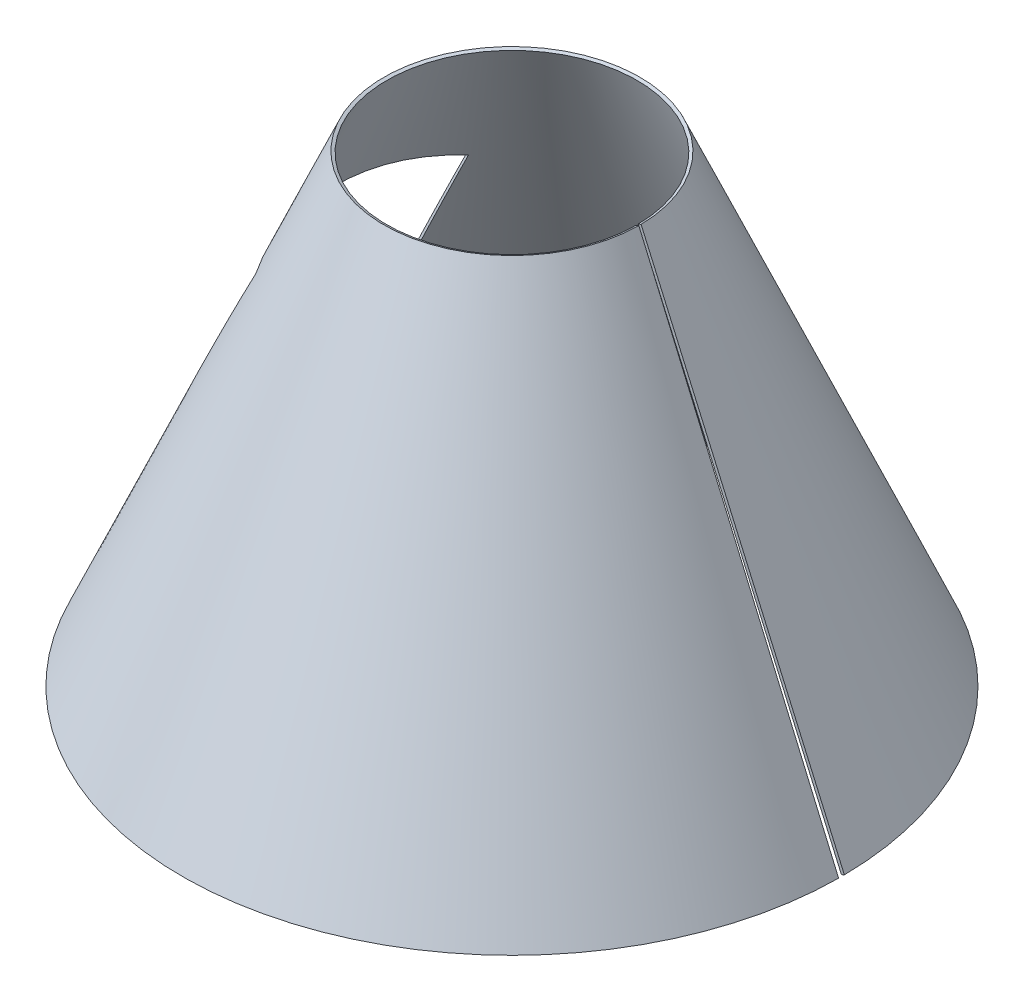
ISO-10303-21;
HEADER;
FILE_DESCRIPTION(('STEP AP214'),'2;1');
FILE_NAME('part.step','',(''),(''),'','','');
FILE_SCHEMA(('AUTOMOTIVE_DESIGN { 1 0 10303 214 1 1 1 1 }'));
ENDSEC;
DATA;
#1=APPLICATION_CONTEXT('core data for automotive mechanical design processes');
#2=APPLICATION_PROTOCOL_DEFINITION('international standard','automotive_design',2000,#1);
#3=PRODUCT_CONTEXT('',#1,'mechanical');
#4=PRODUCT('Part','Part','',(#3));
#5=PRODUCT_RELATED_PRODUCT_CATEGORY('part','',(#4));
#6=PRODUCT_DEFINITION_FORMATION('','',#4);
#7=PRODUCT_DEFINITION_CONTEXT('part definition',#1,'design');
#8=PRODUCT_DEFINITION('design','',#6,#7);
#9=PRODUCT_DEFINITION_SHAPE('','',#8);
#10=(LENGTH_UNIT() NAMED_UNIT(*) SI_UNIT(.MILLI.,.METRE.));
#11=(NAMED_UNIT(*) PLANE_ANGLE_UNIT() SI_UNIT($,.RADIAN.));
#12=(NAMED_UNIT(*) SI_UNIT($,.STERADIAN.) SOLID_ANGLE_UNIT());
#13=UNCERTAINTY_MEASURE_WITH_UNIT(LENGTH_MEASURE(1.E-05),#10,'distance_accuracy_value','');
#14=(GEOMETRIC_REPRESENTATION_CONTEXT(3) GLOBAL_UNCERTAINTY_ASSIGNED_CONTEXT((#13)) GLOBAL_UNIT_ASSIGNED_CONTEXT((#10,
#11,#12)) REPRESENTATION_CONTEXT('',''));
#15=CARTESIAN_POINT('',(0.,0.,0.));
#16=DIRECTION('',(0.,0.,1.));
#17=DIRECTION('',(1.,0.,0.));
#18=AXIS2_PLACEMENT_3D('',#15,#16,#17);
#19=CARTESIAN_POINT('',(-390.673150662865,216.435079884908,-171.737690938259));
#20=CARTESIAN_POINT('',(-377.142683223783,245.126072546884,-171.517261910652));
#21=CARTESIAN_POINT('',(-364.079445057438,272.62887752062,-171.277092645674));
#22=CARTESIAN_POINT('',(-345.188558556074,312.100888842921,-170.875085638939));
#23=CARTESIAN_POINT('',(-339.008901364654,324.96118851652,-170.734289530239));
#24=CARTESIAN_POINT('',(-329.915474925796,343.806081876174,-170.512853786897));
#25=CARTESIAN_POINT('',(-326.913673620994,350.013453637603,-170.437345026818));
#26=CARTESIAN_POINT('',(-322.454971975635,359.213122242057,-170.321620232035));
#27=CARTESIAN_POINT('',(-320.976071302533,362.261113603926,-170.28263564526));
#28=CARTESIAN_POINT('',(-318.768717073403,366.80525338731,-170.223560291441));
#29=CARTESIAN_POINT('',(-318.034765115157,368.31532543854,-170.203768799666));
#30=CARTESIAN_POINT('',(-316.936585865956,370.573471700521,-170.173934347429));
#31=CARTESIAN_POINT('',(-316.570984230142,371.325026818701,-170.163964996646));
#32=CARTESIAN_POINT('',(-316.023268879101,372.450619042264,-170.148974485174));
#33=CARTESIAN_POINT('',(-315.840811612484,372.8255263745,-170.143971567283));
#34=CARTESIAN_POINT('',(-315.567297479185,373.387452259424,-170.136458110032));
#35=CARTESIAN_POINT('',(-315.476154729187,373.574688368827,-170.133952110889));
#36=CARTESIAN_POINT('',(-315.339483544691,373.855433754575,-170.130190847253));
#37=CARTESIAN_POINT('',(-315.293933639942,373.948997420097,-170.128936715222));
#38=CARTESIAN_POINT('',(-315.225619517799,374.089315723793,-170.127054951597));
#39=CARTESIAN_POINT('',(-315.202849932916,374.136083959258,-170.126427602794));
#40=CARTESIAN_POINT('',(-315.168698239316,374.206229513811,-170.125486438274));
#41=CARTESIAN_POINT('',(-315.157314788735,374.229610232225,-170.125172693215));
#42=CARTESIAN_POINT('',(-315.13454878215,374.276369402829,-170.124545156007));
#43=CARTESIAN_POINT('',(-315.125530541461,374.294891869638,-170.124296550306));
#44=CARTESIAN_POINT('',(-301.03544590186,403.234028950793,-169.735819361505));
#45=CARTESIAN_POINT('',(-287.481589285338,430.740189038842,-169.309258917199));
#46=CARTESIAN_POINT('',(-261.433075147547,482.943021837675,-168.333397765728));
#47=CARTESIAN_POINT('',(-248.938581471718,507.639764686927,-167.784168308241));
#48=CARTESIAN_POINT('',(-236.976081085843,530.931623570603,-167.17252728846));
#49=CARTESIAN_POINT('',(-386.475528777364,214.44133454028,-169.892440275844));
#50=CARTESIAN_POINT('',(-372.967732995943,243.132326505835,-169.620437952624));
#51=CARTESIAN_POINT('',(-359.929215840591,270.635132175993,-169.326606269965));
#52=CARTESIAN_POINT('',(-341.078890354475,310.107143498294,-168.841231708122));
#53=CARTESIAN_POINT('',(-334.91333357045,322.967443171892,-168.672167955316));
#54=CARTESIAN_POINT('',(-325.841980224387,341.812336531546,-168.407650523587));
#55=CARTESIAN_POINT('',(-322.847690375846,348.019708292975,-168.317667866462));
#56=CARTESIAN_POINT('',(-318.400493196564,357.219376897429,-168.180067241998));
#57=CARTESIAN_POINT('',(-316.925466893057,360.267368259299,-168.13376321701));
#58=CARTESIAN_POINT('',(-314.723984375424,364.811508042682,-168.063668112135));
#59=CARTESIAN_POINT('',(-313.991999680564,366.321580093912,-168.040196604536));
#60=CARTESIAN_POINT('',(-312.896786470546,368.579726355893,-168.004832062819));
#61=CARTESIAN_POINT('',(-312.532176038479,369.331281474073,-167.993017671262));
#62=CARTESIAN_POINT('',(-311.985951292204,370.456873697636,-167.975257092601));
#63=CARTESIAN_POINT('',(-311.803991527033,370.831781029872,-167.969330401309));
#64=CARTESIAN_POINT('',(-311.53122459733,371.393706914797,-167.960430658757));
#65=CARTESIAN_POINT('',(-311.440331073769,371.5809430242,-167.957462460313));
#66=CARTESIAN_POINT('',(-311.30403396699,371.861688409948,-167.95300774159));
#67=CARTESIAN_POINT('',(-311.25860879449,371.95525207547,-167.95152243184));
#68=CARTESIAN_POINT('',(-311.190481830262,372.095570379165,-167.949293862623));
#69=CARTESIAN_POINT('',(-311.167774641274,372.14233861463,-167.948550905453));
#70=CARTESIAN_POINT('',(-311.133716556405,372.212484169183,-167.947436318634));
#71=CARTESIAN_POINT('',(-311.122364311216,372.235864887598,-167.947064764516));
#72=CARTESIAN_POINT('',(-311.099660720378,372.282624058202,-167.946321605941));
#73=CARTESIAN_POINT('',(-311.090667206449,372.30114652501,-167.946027197162));
#74=CARTESIAN_POINT('',(-297.039221410304,401.240283606165,-167.485981265568));
#75=CARTESIAN_POINT('',(-283.528223926376,428.746443694214,-166.984565951664));
#76=CARTESIAN_POINT('',(-257.575263272773,480.949276493047,-165.853360954649));
#77=CARTESIAN_POINT('',(-245.133466900078,505.646017022941,-165.223641105623));
#78=CARTESIAN_POINT('',(-233.229258238122,528.937878225975,-164.529366671211));
#79=B_SPLINE_SURFACE_WITH_KNOTS('',1,3,((#19,#20,#21,#22,#23,#24,#25,#26,#27,#28,#29,#30,#31,
#32,#33,#34,#35,#36,#37,#38,#39,#40,#41,#42,#43,#44,#45,#46,#47,#48),(#49,#50,#51,#52,#53,#54,
#55,#56,#57,#58,#59,#60,#61,#62,#63,#64,#65,#66,#67,#68,#69,#70,#71,#72,#73,#74,#75,#76,#77,
#78)),.UNSPECIFIED.,.F.,.F.,.F.,(2,2),(4,2,2,2,2,2,2,2,2,2,2,2,2,2,4),(0.,1.),(0.,0.25,0.375,
0.4375,0.46875,0.484375,0.4921875,0.49609375,0.498046875,0.4990234375,0.49951171875,
0.499755859375,0.5,0.75,1.),.UNSPECIFIED.);
#80=CARTESIAN_POINT('',(-386.475528777364,214.44133454028,-169.892440275844));
#81=CARTESIAN_POINT('',(-390.673150662865,216.435079884908,-171.737690938259));
#82=B_SPLINE_CURVE_WITH_KNOTS('',1,(#80,#81),.UNSPECIFIED.,.F.,.F.,(2,2),(0.,1.),.UNSPECIFIED.);
#83=CARTESIAN_POINT('',(-386.475528777363,214.44133454028,-169.892440275844));
#84=VERTEX_POINT('',#83);
#85=CARTESIAN_POINT('',(-390.673150662865,216.435079884908,-171.737690938259));
#86=VERTEX_POINT('',#85);
#87=EDGE_CURVE('E13',#84,#86,#82,.T.);
#88=CARTESIAN_POINT('',(-386.475528777364,214.44133454028,-169.892440275844));
#89=CARTESIAN_POINT('',(-372.967732995943,243.132326505835,-169.620437952624));
#90=CARTESIAN_POINT('',(-359.929215840591,270.635132175993,-169.326606269965));
#91=CARTESIAN_POINT('',(-341.078890354475,310.107143498294,-168.841231708122));
#92=CARTESIAN_POINT('',(-334.91333357045,322.967443171892,-168.672167955316));
#93=CARTESIAN_POINT('',(-325.841980224387,341.812336531546,-168.407650523587));
#94=CARTESIAN_POINT('',(-322.847690375846,348.019708292975,-168.317667866462));
#95=CARTESIAN_POINT('',(-318.400493196564,357.219376897429,-168.180067241998));
#96=CARTESIAN_POINT('',(-316.925466893057,360.267368259299,-168.13376321701));
#97=CARTESIAN_POINT('',(-314.723984375424,364.811508042682,-168.063668112135));
#98=CARTESIAN_POINT('',(-313.991999680564,366.321580093912,-168.040196604536));
#99=CARTESIAN_POINT('',(-312.896786470546,368.579726355893,-168.004832062819));
#100=CARTESIAN_POINT('',(-312.532176038479,369.331281474073,-167.993017671262));
#101=CARTESIAN_POINT('',(-311.985951292204,370.456873697636,-167.975257092601));
#102=CARTESIAN_POINT('',(-311.803991527033,370.831781029872,-167.969330401309));
#103=CARTESIAN_POINT('',(-311.53122459733,371.393706914797,-167.960430658757));
#104=CARTESIAN_POINT('',(-311.440331073769,371.5809430242,-167.957462460313));
#105=CARTESIAN_POINT('',(-311.30403396699,371.861688409948,-167.95300774159));
#106=CARTESIAN_POINT('',(-311.25860879449,371.95525207547,-167.95152243184));
#107=CARTESIAN_POINT('',(-311.190481830262,372.095570379165,-167.949293862623));
#108=CARTESIAN_POINT('',(-311.167774641274,372.14233861463,-167.948550905453));
#109=CARTESIAN_POINT('',(-311.133716556405,372.212484169183,-167.947436318634));
#110=CARTESIAN_POINT('',(-311.122364311216,372.235864887598,-167.947064764516));
#111=CARTESIAN_POINT('',(-311.099660720378,372.282624058202,-167.946321605941));
#112=CARTESIAN_POINT('',(-311.090667206449,372.30114652501,-167.946027197162));
#113=CARTESIAN_POINT('',(-297.039221410304,401.240283606165,-167.485981265568));
#114=CARTESIAN_POINT('',(-283.528223926376,428.746443694214,-166.984565951664));
#115=CARTESIAN_POINT('',(-257.575263272773,480.949276493047,-165.853360954649));
#116=CARTESIAN_POINT('',(-245.133466900078,505.646017022941,-165.223641105623));
#117=CARTESIAN_POINT('',(-233.229258238122,528.937878225975,-164.529366671211));
#118=B_SPLINE_CURVE_WITH_KNOTS('',3,(#88,#89,#90,#91,#92,#93,#94,#95,#96,#97,#98,#99,#100,#101,
#102,#103,#104,#105,#106,#107,#108,#109,#110,#111,#112,#113,#114,#115,#116,#117),.UNSPECIFIED.,
.F.,.F.,(4,2,2,2,2,2,2,2,2,2,2,2,2,2,4),(0.,0.25,0.375,0.4375,0.46875,0.484375,0.4921875,
0.49609375,0.498046875,0.4990234375,0.49951171875,0.499755859375,0.5,0.75,1.),.UNSPECIFIED.);
#119=CARTESIAN_POINT('',(-233.229258238122,528.937878225975,-164.529366671211));
#120=VERTEX_POINT('',#119);
#121=EDGE_CURVE('E149',#84,#120,#118,.T.);
#122=CARTESIAN_POINT('',(-233.229258238122,528.937878225975,-164.529366671211));
#123=CARTESIAN_POINT('',(-236.976081085843,530.931623570603,-167.17252728846));
#124=B_SPLINE_CURVE_WITH_KNOTS('',1,(#122,#123),.UNSPECIFIED.,.F.,.F.,(2,2),(0.,1.),.UNSPECIFIED.);
#125=CARTESIAN_POINT('',(-236.976081085843,530.931623570603,-167.17252728846));
#126=VERTEX_POINT('',#125);
#127=EDGE_CURVE('E108',#120,#126,#124,.T.);
#128=CARTESIAN_POINT('',(-236.976081085843,530.931623570603,-167.17252728846));
#129=CARTESIAN_POINT('',(-248.938581471718,507.639764686927,-167.784168308241));
#130=CARTESIAN_POINT('',(-261.433075147547,482.943021837675,-168.333397765728));
#131=CARTESIAN_POINT('',(-287.481589285338,430.740189038842,-169.309258917199));
#132=CARTESIAN_POINT('',(-301.03544590186,403.234028950793,-169.735819361505));
#133=CARTESIAN_POINT('',(-315.125530541461,374.294891869638,-170.124296550306));
#134=CARTESIAN_POINT('',(-315.13454878215,374.276369402829,-170.124545156007));
#135=CARTESIAN_POINT('',(-315.157314788735,374.229610232225,-170.125172693215));
#136=CARTESIAN_POINT('',(-315.168698239316,374.206229513811,-170.125486438274));
#137=CARTESIAN_POINT('',(-315.202849932916,374.136083959258,-170.126427602794));
#138=CARTESIAN_POINT('',(-315.225619517799,374.089315723793,-170.127054951597));
#139=CARTESIAN_POINT('',(-315.293933639942,373.948997420097,-170.128936715222));
#140=CARTESIAN_POINT('',(-315.339483544691,373.855433754575,-170.130190847253));
#141=CARTESIAN_POINT('',(-315.476154729187,373.574688368827,-170.133952110889));
#142=CARTESIAN_POINT('',(-315.567297479185,373.387452259424,-170.136458110032));
#143=CARTESIAN_POINT('',(-315.840811612484,372.8255263745,-170.143971567283));
#144=CARTESIAN_POINT('',(-316.023268879101,372.450619042264,-170.148974485174));
#145=CARTESIAN_POINT('',(-316.570984230142,371.325026818701,-170.163964996646));
#146=CARTESIAN_POINT('',(-316.936585865956,370.573471700521,-170.173934347429));
#147=CARTESIAN_POINT('',(-318.034765115157,368.31532543854,-170.203768799666));
#148=CARTESIAN_POINT('',(-318.768717073403,366.80525338731,-170.223560291441));
#149=CARTESIAN_POINT('',(-320.976071302533,362.261113603926,-170.28263564526));
#150=CARTESIAN_POINT('',(-322.454971975635,359.213122242057,-170.321620232035));
#151=CARTESIAN_POINT('',(-326.913673620994,350.013453637603,-170.437345026818));
#152=CARTESIAN_POINT('',(-329.915474925796,343.806081876174,-170.512853786897));
#153=CARTESIAN_POINT('',(-339.008901364654,324.96118851652,-170.734289530239));
#154=CARTESIAN_POINT('',(-345.188558556074,312.100888842921,-170.875085638939));
#155=CARTESIAN_POINT('',(-364.079445057438,272.62887752062,-171.277092645674));
#156=CARTESIAN_POINT('',(-377.142683223783,245.126072546884,-171.517261910652));
#157=CARTESIAN_POINT('',(-390.673150662865,216.435079884908,-171.737690938259));
#158=B_SPLINE_CURVE_WITH_KNOTS('',3,(#128,#129,#130,#131,#132,#133,#134,#135,#136,#137,#138,
#139,#140,#141,#142,#143,#144,#145,#146,#147,#148,#149,#150,#151,#152,#153,#154,#155,#156,#157),
.UNSPECIFIED.,.F.,.F.,(4,2,2,2,2,2,2,2,2,2,2,2,2,2,4),(0.,0.25,0.5,0.500244140625,0.50048828125,
0.5009765625,0.501953125,0.50390625,0.5078125,0.515625,0.53125,0.5625,0.625,0.75,1.),.UNSPECIFIED.);
#159=EDGE_CURVE('E153',#86,#126,#158,.F.);
#160=ORIENTED_EDGE('',*,*,#87,.F.);
#161=ORIENTED_EDGE('',*,*,#121,.T.);
#162=ORIENTED_EDGE('',*,*,#127,.T.);
#163=ORIENTED_EDGE('',*,*,#159,.F.);
#164=EDGE_LOOP('',(#160,#161,#162,#163));
#165=FACE_BOUND('',#164,.T.);
#166=ADVANCED_FACE('F94',(#165),#79,.T.);
#167=CARTESIAN_POINT('',(-236.976081085843,530.931623570603,-167.17252728846));
#168=CARTESIAN_POINT('',(-251.323305995867,537.516709583,-141.867408016106));
#169=CARTESIAN_POINT('',(-262.434664577007,542.456126064863,-114.865438189882));
#170=CARTESIAN_POINT('',(-277.481132754529,549.041682717702,-58.705011994568));
#171=CARTESIAN_POINT('',(-281.416917434273,550.688145749705,-29.542896380577));
#172=CARTESIAN_POINT('',(-281.417079012583,550.688441308532,29.5401329297532));
#173=CARTESIAN_POINT('',(-277.480645448042,549.042126035032,58.70660870777));
#174=CARTESIAN_POINT('',(-262.433484551877,542.456569382198,114.867768240006));
#175=CARTESIAN_POINT('',(-251.32208458411,537.517001462712,141.8689192674));
#176=CARTESIAN_POINT('',(-236.976081085524,530.931623570624,167.172527288895));
#177=CARTESIAN_POINT('',(-233.229258238122,528.937878225975,-164.529366671211));
#178=CARTESIAN_POINT('',(-247.312678995283,535.522979328195,-139.598192642879));
#179=CARTESIAN_POINT('',(-258.21308199642,540.462380720236,-113.015125673388));
#180=CARTESIAN_POINT('',(-272.972164402214,547.047937373074,-57.7486541686274));
#181=CARTESIAN_POINT('',(-276.831619425719,548.694400405078,-29.0615357853971));
#182=CARTESIAN_POINT('',(-276.831776277398,548.694695963905,29.0588173611785));
#183=CARTESIAN_POINT('',(-272.971681963581,547.048380690405,57.7502242474028));
#184=CARTESIAN_POINT('',(-258.21191812975,540.462824037571,113.017416953411));
#185=CARTESIAN_POINT('',(-247.311475295622,535.523271228603,139.599678770708));
#186=CARTESIAN_POINT('',(-233.229258237808,528.937878225996,164.52936667164));
#187=B_SPLINE_SURFACE_WITH_KNOTS('',1,3,((#167,#168,#169,#170,#171,#172,#173,#174,#175,#176),
(#177,#178,#179,#180,#181,#182,#183,#184,#185,#186)),.UNSPECIFIED.,.F.,.F.,.F.,(2,2),(4,2,2,2,
4),(0.,1.),(0.,0.25,0.5,0.75,1.),.UNSPECIFIED.);
#188=CARTESIAN_POINT('',(-233.229258238122,528.937878225975,-164.529366671211));
#189=CARTESIAN_POINT('',(-247.312678995283,535.522979328195,-139.598192642879));
#190=CARTESIAN_POINT('',(-258.21308199642,540.462380720236,-113.015125673388));
#191=CARTESIAN_POINT('',(-272.972164402214,547.047937373074,-57.7486541686274));
#192=CARTESIAN_POINT('',(-276.831619425719,548.694400405078,-29.0615357853971));
#193=CARTESIAN_POINT('',(-276.831776277398,548.694695963905,29.0588173611785));
#194=CARTESIAN_POINT('',(-272.971681963581,547.048380690405,57.7502242474028));
#195=CARTESIAN_POINT('',(-258.21191812975,540.462824037571,113.017416953411));
#196=CARTESIAN_POINT('',(-247.311475295622,535.523271228603,139.599678770708));
#197=CARTESIAN_POINT('',(-233.229258237808,528.937878225996,164.52936667164));
#198=B_SPLINE_CURVE_WITH_KNOTS('',3,(#188,#189,#190,#191,#192,#193,#194,#195,#196,#197),
.UNSPECIFIED.,.F.,.F.,(4,2,2,2,4),(0.,0.25,0.5,0.75,1.),.UNSPECIFIED.);
#199=CARTESIAN_POINT('',(-233.229258237808,528.937878225996,164.529366671639));
#200=VERTEX_POINT('',#199);
#201=EDGE_CURVE('E171',#120,#200,#198,.T.);
#202=CARTESIAN_POINT('',(-233.229258237808,528.937878225996,164.52936667164));
#203=CARTESIAN_POINT('',(-236.976081085524,530.931623570624,167.172527288895));
#204=B_SPLINE_CURVE_WITH_KNOTS('',1,(#202,#203),.UNSPECIFIED.,.F.,.F.,(2,2),(0.,1.),.UNSPECIFIED.);
#205=CARTESIAN_POINT('',(-236.976081085524,530.931623570624,167.172527288895));
#206=VERTEX_POINT('',#205);
#207=EDGE_CURVE('E208',#200,#206,#204,.T.);
#208=CARTESIAN_POINT('',(-236.976081085524,530.931623570624,167.172527288895));
#209=CARTESIAN_POINT('',(-251.32208458411,537.517001462712,141.8689192674));
#210=CARTESIAN_POINT('',(-262.433484551877,542.456569382198,114.867768240006));
#211=CARTESIAN_POINT('',(-277.480645448042,549.042126035032,58.70660870777));
#212=CARTESIAN_POINT('',(-281.417079012583,550.688441308532,29.5401329297532));
#213=CARTESIAN_POINT('',(-281.416917434273,550.688145749705,-29.542896380577));
#214=CARTESIAN_POINT('',(-277.481132754529,549.041682717702,-58.705011994568));
#215=CARTESIAN_POINT('',(-262.434664577007,542.456126064863,-114.865438189882));
#216=CARTESIAN_POINT('',(-251.323305995867,537.516709583,-141.867408016106));
#217=CARTESIAN_POINT('',(-236.976081085843,530.931623570603,-167.17252728846));
#218=B_SPLINE_CURVE_WITH_KNOTS('',3,(#208,#209,#210,#211,#212,#213,#214,#215,#216,#217),
.UNSPECIFIED.,.F.,.F.,(4,2,2,2,4),(0.,0.25,0.5,0.75,1.),.UNSPECIFIED.);
#219=EDGE_CURVE('E331',#126,#206,#218,.F.);
#220=ORIENTED_EDGE('',*,*,#127,.F.);
#221=ORIENTED_EDGE('',*,*,#201,.T.);
#222=ORIENTED_EDGE('',*,*,#207,.T.);
#223=ORIENTED_EDGE('',*,*,#219,.F.);
#224=EDGE_LOOP('',(#220,#221,#222,#223));
#225=FACE_BOUND('',#224,.T.);
#226=ADVANCED_FACE('F215',(#225),#187,.T.);
#227=CARTESIAN_POINT('',(-236.976081085524,530.931623570624,167.172527288895));
#228=CARTESIAN_POINT('',(-248.938581454255,507.639764720328,167.784168307821));
#229=CARTESIAN_POINT('',(-261.433075120931,482.943021887761,168.333397766826));
#230=CARTESIAN_POINT('',(-280.9694607239,443.790897288636,169.065293631943));
#231=CARTESIAN_POINT('',(-287.613932122674,430.389003162598,169.294264174531));
#232=CARTESIAN_POINT('',(-297.777991958567,409.759383084043,169.618480317016));
#233=CARTESIAN_POINT('',(-301.198899788214,402.795046576273,169.723367286214));
#234=CARTESIAN_POINT('',(-306.37941519423,392.216847092248,169.876522057982));
#235=CARTESIAN_POINT('',(-308.114445738627,388.668831477179,169.926879066727));
#236=CARTESIAN_POINT('',(-310.729255731652,383.313884373979,170.001460273809));
#237=CARTESIAN_POINT('',(-311.60290308127,381.523414726144,170.026161710959));
#238=CARTESIAN_POINT('',(-312.916437048511,378.829479334248,170.062987137892));
#239=CARTESIAN_POINT('',(-313.354792194105,377.930129050256,170.075224497447));
#240=CARTESIAN_POINT('',(-314.013090256152,376.579045894234,170.093525375928));
#241=CARTESIAN_POINT('',(-314.23265050074,376.128341887223,170.099616475616));
#242=CARTESIAN_POINT('',(-314.562182154259,375.451771444193,170.108739527627));
#243=CARTESIAN_POINT('',(-314.672057919867,375.226162224432,170.111778278732));
#244=CARTESIAN_POINT('',(-314.836919383765,374.887619786663,170.116333030253));
#245=CARTESIAN_POINT('',(-314.891881174312,374.77475087272,170.117850718239));
#246=CARTESIAN_POINT('',(-314.974335813228,374.605415349772,170.120126409475));
#247=CARTESIAN_POINT('',(-315.001822685049,374.548964816785,170.120884833095));
#248=CARTESIAN_POINT('',(-315.043055980959,374.464280979295,170.122022258722));
#249=CARTESIAN_POINT('',(-315.056800910961,374.436051693791,170.122401365631));
#250=CARTESIAN_POINT('',(-315.084291767004,374.379590443459,170.123159509576));
#251=CARTESIAN_POINT('',(-315.100402008404,374.346502493162,170.123603733061));
#252=CARTESIAN_POINT('',(-326.767063425402,350.384750479868,170.445264809241));
#253=CARTESIAN_POINT('',(-338.891596354047,325.258226025306,170.7410833002));
#254=CARTESIAN_POINT('',(-364.079445022131,272.628877595571,171.277092644155));
#255=CARTESIAN_POINT('',(-377.142683199905,245.126072596854,171.517261910949));
#256=CARTESIAN_POINT('',(-390.673150662546,216.435079884922,171.737690938964));
#257=CARTESIAN_POINT('',(-233.229258237808,528.937878225996,164.52936667164));
#258=CARTESIAN_POINT('',(-245.133466882703,505.646017056342,165.223641105078));
#259=CARTESIAN_POINT('',(-257.57526324628,480.949276543133,165.853360955557));
#260=CARTESIAN_POINT('',(-277.039983736101,441.797151944008,166.701764704828));
#261=CARTESIAN_POINT('',(-283.661796621379,428.39525781797,166.968868934795));
#262=CARTESIAN_POINT('',(-293.793588444839,407.765637739415,167.349125171656));
#263=CARTESIAN_POINT('',(-297.204026919509,400.801301231646,167.472498895431));
#264=CARTESIAN_POINT('',(-302.369252886733,390.223101747621,167.653081631403));
#265=CARTESIAN_POINT('',(-304.099256052432,386.675086132552,167.712530941223));
#266=CARTESIAN_POINT('',(-306.706626725088,381.320139029352,167.800673605276));
#267=CARTESIAN_POINT('',(-307.577811259333,379.529669381517,167.829882696104));
#268=CARTESIAN_POINT('',(-308.887676203955,376.83573398962,167.873450176687));
#269=CARTESIAN_POINT('',(-309.324812542092,375.936383705629,167.887931649675));
#270=CARTESIAN_POINT('',(-309.981288663574,374.585300549606,167.909593819524));
#271=CARTESIAN_POINT('',(-310.200242639744,374.134596542595,167.916804536539));
#272=CARTESIAN_POINT('',(-310.52886645461,373.458026099565,167.927605792101));
#273=CARTESIAN_POINT('',(-310.638439867997,373.232416879805,167.931203740649));
#274=CARTESIAN_POINT('',(-310.802848194095,372.893874442035,167.936596982383));
#275=CARTESIAN_POINT('',(-310.857659003797,372.781005528093,167.938394116115));
#276=CARTESIAN_POINT('',(-310.939887269023,372.611670005144,167.941088899437));
#277=CARTESIAN_POINT('',(-310.96729869921,372.555219472158,167.941987007665));
#278=CARTESIAN_POINT('',(-311.008418857056,372.470535634668,167.943333941065));
#279=CARTESIAN_POINT('',(-311.022126078434,372.442306349164,167.943782880709));
#280=CARTESIAN_POINT('',(-311.049541525357,372.385845098832,167.944680683742));
#281=CARTESIAN_POINT('',(-311.065607582665,372.352757148535,167.945206742813));
#282=CARTESIAN_POINT('',(-322.700275841644,348.39100513524,168.326127100392));
#283=CARTESIAN_POINT('',(-334.795448490935,323.264480680678,168.679440184208));
#284=CARTESIAN_POINT('',(-359.92921580535,270.635132250944,169.326606268306));
#285=CARTESIAN_POINT('',(-372.967732972109,243.132326555805,169.620437952825));
#286=CARTESIAN_POINT('',(-386.475528777048,214.441334540294,169.892440276543));
#287=B_SPLINE_SURFACE_WITH_KNOTS('',1,3,((#227,#228,#229,#230,#231,#232,#233,#234,#235,#236,
#237,#238,#239,#240,#241,#242,#243,#244,#245,#246,#247,#248,#249,#250,#251,#252,#253,#254,#255,
#256),(#257,#258,#259,#260,#261,#262,#263,#264,#265,#266,#267,#268,#269,#270,#271,#272,#273,
#274,#275,#276,#277,#278,#279,#280,#281,#282,#283,#284,#285,#286)),.UNSPECIFIED.,.F.,.F.,.F.,(2,
2),(4,2,2,2,2,2,2,2,2,2,2,2,2,2,4),(0.,1.),(0.,0.25,0.375,0.4375,0.46875,0.484375,0.4921875,
0.49609375,0.498046875,0.4990234375,0.49951171875,0.499755859375,0.5,0.75,1.),.UNSPECIFIED.);
#288=CARTESIAN_POINT('',(-233.229258237808,528.937878225996,164.52936667164));
#289=CARTESIAN_POINT('',(-245.133466882703,505.646017056342,165.223641105078));
#290=CARTESIAN_POINT('',(-257.57526324628,480.949276543133,165.853360955557));
#291=CARTESIAN_POINT('',(-277.039983736101,441.797151944008,166.701764704828));
#292=CARTESIAN_POINT('',(-283.661796621379,428.39525781797,166.968868934795));
#293=CARTESIAN_POINT('',(-293.793588444839,407.765637739415,167.349125171656));
#294=CARTESIAN_POINT('',(-297.204026919509,400.801301231646,167.472498895431));
#295=CARTESIAN_POINT('',(-302.369252886733,390.223101747621,167.653081631403));
#296=CARTESIAN_POINT('',(-304.099256052432,386.675086132552,167.712530941223));
#297=CARTESIAN_POINT('',(-306.706626725088,381.320139029352,167.800673605276));
#298=CARTESIAN_POINT('',(-307.577811259333,379.529669381517,167.829882696104));
#299=CARTESIAN_POINT('',(-308.887676203955,376.83573398962,167.873450176687));
#300=CARTESIAN_POINT('',(-309.324812542092,375.936383705629,167.887931649675));
#301=CARTESIAN_POINT('',(-309.981288663574,374.585300549606,167.909593819524));
#302=CARTESIAN_POINT('',(-310.200242639744,374.134596542595,167.916804536539));
#303=CARTESIAN_POINT('',(-310.52886645461,373.458026099565,167.927605792101));
#304=CARTESIAN_POINT('',(-310.638439867997,373.232416879805,167.931203740649));
#305=CARTESIAN_POINT('',(-310.802848194095,372.893874442035,167.936596982383));
#306=CARTESIAN_POINT('',(-310.857659003797,372.781005528093,167.938394116115));
#307=CARTESIAN_POINT('',(-310.939887269023,372.611670005144,167.941088899437));
#308=CARTESIAN_POINT('',(-310.96729869921,372.555219472158,167.941987007665));
#309=CARTESIAN_POINT('',(-311.008418857056,372.470535634668,167.943333941065));
#310=CARTESIAN_POINT('',(-311.022126078434,372.442306349164,167.943782880709));
#311=CARTESIAN_POINT('',(-311.049541525357,372.385845098832,167.944680683742));
#312=CARTESIAN_POINT('',(-311.065607582665,372.352757148535,167.945206742813));
#313=CARTESIAN_POINT('',(-322.700275841644,348.39100513524,168.326127100392));
#314=CARTESIAN_POINT('',(-334.795448490935,323.264480680678,168.679440184208));
#315=CARTESIAN_POINT('',(-359.92921580535,270.635132250944,169.326606268306));
#316=CARTESIAN_POINT('',(-372.967732972109,243.132326555805,169.620437952825));
#317=CARTESIAN_POINT('',(-386.475528777048,214.441334540294,169.892440276543));
#318=B_SPLINE_CURVE_WITH_KNOTS('',3,(#288,#289,#290,#291,#292,#293,#294,#295,#296,#297,#298,
#299,#300,#301,#302,#303,#304,#305,#306,#307,#308,#309,#310,#311,#312,#313,#314,#315,#316,#317),
.UNSPECIFIED.,.F.,.F.,(4,2,2,2,2,2,2,2,2,2,2,2,2,2,4),(0.,0.25,0.375,0.4375,0.46875,0.484375,
0.4921875,0.49609375,0.498046875,0.4990234375,0.49951171875,0.499755859375,0.5,0.75,1.),.UNSPECIFIED.);
#319=CARTESIAN_POINT('',(-386.475528777049,214.441334540295,169.892440276543));
#320=VERTEX_POINT('',#319);
#321=EDGE_CURVE('E178',#200,#320,#318,.T.);
#322=CARTESIAN_POINT('',(-386.475528777048,214.441334540294,169.892440276543));
#323=CARTESIAN_POINT('',(-390.673150662546,216.435079884922,171.737690938964));
#324=B_SPLINE_CURVE_WITH_KNOTS('',1,(#322,#323),.UNSPECIFIED.,.F.,.F.,(2,2),(0.,1.),.UNSPECIFIED.);
#325=CARTESIAN_POINT('',(-390.673150662546,216.435079884922,171.737690938964));
#326=VERTEX_POINT('',#325);
#327=EDGE_CURVE('E116',#320,#326,#324,.T.);
#328=CARTESIAN_POINT('',(-390.673150662546,216.435079884922,171.737690938964));
#329=CARTESIAN_POINT('',(-377.142683199905,245.126072596854,171.517261910949));
#330=CARTESIAN_POINT('',(-364.079445022131,272.628877595571,171.277092644155));
#331=CARTESIAN_POINT('',(-338.891596354047,325.258226025306,170.7410833002));
#332=CARTESIAN_POINT('',(-326.767063425402,350.384750479868,170.445264809241));
#333=CARTESIAN_POINT('',(-315.100402008404,374.346502493162,170.123603733061));
#334=CARTESIAN_POINT('',(-315.084291767004,374.379590443459,170.123159509576));
#335=CARTESIAN_POINT('',(-315.056800910961,374.436051693791,170.122401365631));
#336=CARTESIAN_POINT('',(-315.043055980959,374.464280979295,170.122022258722));
#337=CARTESIAN_POINT('',(-315.001822685049,374.548964816785,170.120884833095));
#338=CARTESIAN_POINT('',(-314.974335813228,374.605415349772,170.120126409475));
#339=CARTESIAN_POINT('',(-314.891881174312,374.77475087272,170.117850718239));
#340=CARTESIAN_POINT('',(-314.836919383765,374.887619786663,170.116333030253));
#341=CARTESIAN_POINT('',(-314.672057919867,375.226162224432,170.111778278732));
#342=CARTESIAN_POINT('',(-314.562182154259,375.451771444193,170.108739527627));
#343=CARTESIAN_POINT('',(-314.23265050074,376.128341887223,170.099616475616));
#344=CARTESIAN_POINT('',(-314.013090256152,376.579045894234,170.093525375928));
#345=CARTESIAN_POINT('',(-313.354792194105,377.930129050256,170.075224497447));
#346=CARTESIAN_POINT('',(-312.916437048511,378.829479334248,170.062987137892));
#347=CARTESIAN_POINT('',(-311.60290308127,381.523414726144,170.026161710959));
#348=CARTESIAN_POINT('',(-310.729255731652,383.313884373979,170.001460273809));
#349=CARTESIAN_POINT('',(-308.114445738627,388.668831477179,169.926879066727));
#350=CARTESIAN_POINT('',(-306.37941519423,392.216847092248,169.876522057982));
#351=CARTESIAN_POINT('',(-301.198899788214,402.795046576273,169.723367286214));
#352=CARTESIAN_POINT('',(-297.777991958567,409.759383084043,169.618480317016));
#353=CARTESIAN_POINT('',(-287.613932122674,430.389003162598,169.294264174531));
#354=CARTESIAN_POINT('',(-280.9694607239,443.790897288636,169.065293631943));
#355=CARTESIAN_POINT('',(-261.433075120931,482.943021887761,168.333397766826));
#356=CARTESIAN_POINT('',(-248.938581454255,507.639764720328,167.784168307821));
#357=CARTESIAN_POINT('',(-236.976081085524,530.931623570624,167.172527288895));
#358=B_SPLINE_CURVE_WITH_KNOTS('',3,(#328,#329,#330,#331,#332,#333,#334,#335,#336,#337,#338,
#339,#340,#341,#342,#343,#344,#345,#346,#347,#348,#349,#350,#351,#352,#353,#354,#355,#356,#357),
.UNSPECIFIED.,.F.,.F.,(4,2,2,2,2,2,2,2,2,2,2,2,2,2,4),(0.,0.25,0.5,0.500244140625,0.50048828125,
0.5009765625,0.501953125,0.50390625,0.5078125,0.515625,0.53125,0.5625,0.625,0.75,1.),.UNSPECIFIED.);
#359=EDGE_CURVE('E299',#206,#326,#358,.F.);
#360=ORIENTED_EDGE('',*,*,#207,.F.);
#361=ORIENTED_EDGE('',*,*,#321,.T.);
#362=ORIENTED_EDGE('',*,*,#327,.T.);
#363=ORIENTED_EDGE('',*,*,#359,.F.);
#364=EDGE_LOOP('',(#360,#361,#362,#363));
#365=FACE_BOUND('',#364,.T.);
#366=ADVANCED_FACE('F226',(#365),#287,.T.);
#367=CARTESIAN_POINT('',(519.97637798977,1.99374534462858,4.53776510503048));
#368=DIRECTION('',(0.00872653549836627,0.,-0.999961923064171));
#369=DIRECTION('',(-0.398733885782559,0.917060074385114,-0.00347969790491685));
#370=AXIS2_PLACEMENT_3D('',#367,#368,#369);
#371=PLANE('',#370);
#372=DIRECTION('',(0.917025155547511,0.398749068925268,0.00800275729325633));
#373=VECTOR('',#372,1.);
#374=CARTESIAN_POINT('',(519.97637798977,1.99374534462858,4.53776510503048));
#375=LINE('',#374,#373);
#376=CARTESIAN_POINT('',(515.391252212072,-8.5265128291212E-11,4.49775131856458));
#377=VERTEX_POINT('',#376);
#378=CARTESIAN_POINT('',(519.97637798977,1.99374534462858,4.53776510503048));
#379=VERTEX_POINT('',#378);
#380=EDGE_CURVE('E199',#377,#379,#375,.T.);
#381=ORIENTED_EDGE('',*,*,#380,.F.);
#382=DIRECTION('',(0.39873388578256,-0.917060074385114,0.003479697904917));
#383=VECTOR('',#382,1.);
#384=CARTESIAN_POINT('',(10675.0108176189,-23366.4150617418,93.1594080702017));
#385=LINE('',#384,#383);
#386=CARTESIAN_POINT('',(197.407182681217,731.341139679902,1.72274638420369));
#387=VERTEX_POINT('',#386);
#388=EDGE_CURVE('E302',#377,#387,#385,.F.);
#389=ORIENTED_EDGE('',*,*,#388,.T.);
#390=DIRECTION('',(0.917025155547511,0.398749068925268,0.00800275729325669));
#391=VECTOR('',#390,1.);
#392=CARTESIAN_POINT('',(201.992308458953,733.334885024531,1.76276017067003));
#393=LINE('',#392,#391);
#394=CARTESIAN_POINT('',(201.992308458953,733.334885024531,1.76276017067003));
#395=VERTEX_POINT('',#394);
#396=EDGE_CURVE('E195',#387,#395,#393,.T.);
#397=ORIENTED_EDGE('',*,*,#396,.T.);
#398=DIRECTION('',(-0.398733885782559,0.917060074385114,-0.00347969790491685));
#399=VECTOR('',#398,1.);
#400=CARTESIAN_POINT('',(519.97637798977,1.99374534462858,4.53776510503048));
#401=LINE('',#400,#399);
#402=EDGE_CURVE('E177',#379,#395,#401,.T.);
#403=ORIENTED_EDGE('',*,*,#402,.F.);
#404=EDGE_LOOP('',(#381,#389,#397,#403));
#405=FACE_BOUND('',#404,.T.);
#406=ADVANCED_FACE('F427',(#405),#371,.T.);
#407=CARTESIAN_POINT('',(-5.57629998089922E-11,733.334885024554,-4.86154645889495E-13));
#408=DIRECTION('',(1.21673950867233E-13,1.,0.));
#409=DIRECTION('',(-1.,1.21673950867233E-13,0.));
#410=AXIS2_PLACEMENT_3D('',#407,#408,#409);
#411=CONICAL_SURFACE('',#410,202.000000000065,1.16064395257608);
#412=ORIENTED_EDGE('',*,*,#396,.F.);
#413=CARTESIAN_POINT('',(-5.60055866820962E-11,731.341139679927,-4.88269573992274E-13));
#414=DIRECTION('',(-1.21673950867233E-13,-1.,0.));
#415=DIRECTION('',(1.,-1.21673950867233E-13,0.));
#416=AXIS2_PLACEMENT_3D('',#413,#414,#415);
#417=CIRCLE('',#416,197.414699628121);
#418=CARTESIAN_POINT('',(197.407182681215,731.341139679902,-1.72274638457619));
#419=VERTEX_POINT('',#418);
#420=EDGE_CURVE('E304',#387,#419,#417,.T.);
#421=ORIENTED_EDGE('',*,*,#420,.T.);
#422=DIRECTION('',(0.917025155547494,0.398749068925268,-0.00800275729517442));
#423=VECTOR('',#422,1.);
#424=CARTESIAN_POINT('',(201.992308458969,733.33488502453,-1.76276017109378));
#425=LINE('',#424,#423);
#426=CARTESIAN_POINT('',(201.992308458969,733.33488502453,-1.76276017109378));
#427=VERTEX_POINT('',#426);
#428=EDGE_CURVE('E187',#419,#427,#425,.T.);
#429=ORIENTED_EDGE('',*,*,#428,.T.);
#430=CARTESIAN_POINT('',(-5.57629998089922E-11,733.334885024554,-4.86154645889495E-13));
#431=DIRECTION('',(-1.21673950867233E-13,-1.,0.));
#432=DIRECTION('',(1.,-1.21673950867233E-13,0.));
#433=AXIS2_PLACEMENT_3D('',#430,#431,#432);
#434=CIRCLE('',#433,202.000000000065);
#435=EDGE_CURVE('E332',#395,#427,#434,.T.);
#436=ORIENTED_EDGE('',*,*,#435,.F.);
#437=EDGE_LOOP('',(#412,#421,#429,#436));
#438=FACE_BOUND('',#437,.T.);
#439=ADVANCED_FACE('F340',(#438),#411,.F.);
#440=CARTESIAN_POINT('',(201.992308458988,733.334885024443,-1.76276017109383));
#441=DIRECTION('',(0.00872653549998118,0.,0.999961923064157));
#442=DIRECTION('',(0.398733885782552,-0.917060074385115,-0.00347969790556273));
#443=AXIS2_PLACEMENT_3D('',#440,#441,#442);
#444=PLANE('',#443);
#445=ORIENTED_EDGE('',*,*,#428,.F.);
#446=DIRECTION('',(0.398733885782554,-0.917060074385114,-0.00347969790566935));
#447=VECTOR('',#446,1.);
#448=CARTESIAN_POINT('',(10675.0108176187,-23366.4150617418,-93.1594080903438));
#449=LINE('',#448,#447);
#450=CARTESIAN_POINT('',(515.391252212065,-8.5265128291212E-11,-4.49775131953707));
#451=VERTEX_POINT('',#450);
#452=EDGE_CURVE('E291',#419,#451,#449,.T.);
#453=ORIENTED_EDGE('',*,*,#452,.T.);
#454=DIRECTION('',(0.917025155547496,0.398749068925268,-0.00800275729490625));
#455=VECTOR('',#454,1.);
#456=CARTESIAN_POINT('',(519.9763779898,1.99374534454122,-4.53776510596936));
#457=LINE('',#456,#455);
#458=CARTESIAN_POINT('',(519.9763779898,1.99374534454122,-4.53776510596936));
#459=VERTEX_POINT('',#458);
#460=EDGE_CURVE('E196',#451,#459,#457,.T.);
#461=ORIENTED_EDGE('',*,*,#460,.T.);
#462=DIRECTION('',(0.398733885782552,-0.917060074385115,-0.00347969790556273));
#463=VECTOR('',#462,1.);
#464=CARTESIAN_POINT('',(201.992308458988,733.334885024443,-1.76276017109383));
#465=LINE('',#464,#463);
#466=EDGE_CURVE('E329',#427,#459,#465,.T.);
#467=ORIENTED_EDGE('',*,*,#466,.F.);
#468=EDGE_LOOP('',(#445,#453,#461,#467));
#469=FACE_BOUND('',#468,.T.);
#470=ADVANCED_FACE('F314',(#469),#444,.T.);
#471=CARTESIAN_POINT('',(-1.44748165705597E-10,1.99374534460617,-1.26194776971868E-12));
#472=DIRECTION('',(1.21673950867233E-13,1.,0.));
#473=DIRECTION('',(-1.,1.21673950867233E-13,0.));
#474=AXIS2_PLACEMENT_3D('',#471,#472,#473);
#475=CONICAL_SURFACE('',#474,519.996177851029,1.16064395257608);
#476=CARTESIAN_POINT('',(-1.449907525787E-10,-2.1316282072803E-11,-1.26406269782146E-12));
#477=DIRECTION('',(-1.21673950867233E-13,-1.,0.));
#478=DIRECTION('',(1.,-1.21673950867233E-13,0.));
#479=AXIS2_PLACEMENT_3D('',#476,#477,#478);
#480=CIRCLE('',#479,515.410877479123);
#481=EDGE_CURVE('E173',#451,#377,#480,.F.);
#482=ORIENTED_EDGE('',*,*,#481,.T.);
#483=ORIENTED_EDGE('',*,*,#380,.T.);
#484=CARTESIAN_POINT('',(-1.44748165705597E-10,1.99374534460617,-1.26194776971868E-12));
#485=DIRECTION('',(1.21673950867233E-13,1.,0.));
#486=DIRECTION('',(-1.,1.21673950867233E-13,0.));
#487=AXIS2_PLACEMENT_3D('',#484,#485,#486);
#488=CIRCLE('',#487,519.996177851029);
#489=EDGE_CURVE('E289',#459,#379,#488,.T.);
#490=ORIENTED_EDGE('',*,*,#489,.F.);
#491=ORIENTED_EDGE('',*,*,#460,.F.);
#492=EDGE_LOOP('',(#482,#483,#490,#491));
#493=FACE_BOUND('',#492,.T.);
#494=ADVANCED_FACE('F321',(#493),#475,.T.);
#495=CARTESIAN_POINT('',(-390.673150662546,216.435079884922,171.737690938964));
#496=CARTESIAN_POINT('',(-400.628476937858,220.862521619933,144.307332652639));
#497=CARTESIAN_POINT('',(-408.206017808532,224.183164394453,116.074793373234));
#498=CARTESIAN_POINT('',(-418.381338902534,228.610560209739,58.6188071874206));
#499=CARTESIAN_POINT('',(-420.979216761218,229.717361877593,29.3913926732848));
#500=CARTESIAN_POINT('',(-420.979128078969,229.717172783957,-29.3938404442639));
#501=CARTESIAN_POINT('',(-418.381664670974,228.610276556727,-58.6171694205554));
#502=CARTESIAN_POINT('',(-408.206791618129,224.182880741441,-116.072421225786));
#503=CARTESIAN_POINT('',(-400.62928356619,220.862333611396,-144.305700852749));
#504=CARTESIAN_POINT('',(-390.673150662865,216.435079884908,-171.737690938259));
#505=CARTESIAN_POINT('',(-386.475528777048,214.441334540294,169.892440276543));
#506=CARTESIAN_POINT('',(-396.304956713412,218.868777706684,142.748477101666));
#507=CARTESIAN_POINT('',(-403.785260964786,222.189419049826,114.816989532367));
#508=CARTESIAN_POINT('',(-413.829686617185,226.616814865111,57.9803535501884));
#509=CARTESIAN_POINT('',(-416.393915458579,227.723616532965,29.0712619576002));
#510=CARTESIAN_POINT('',(-416.393828637798,227.72342743933,-29.0736830674856));
#511=CARTESIAN_POINT('',(-413.83001016783,226.616531212099,-57.9787337975197));
#512=CARTESIAN_POINT('',(-403.78602767622,222.189135396814,-114.814643451031));
#513=CARTESIAN_POINT('',(-396.305755472387,218.868589695016,-142.746863206567));
#514=CARTESIAN_POINT('',(-386.475528777364,214.44133454028,-169.892440275844));
#515=B_SPLINE_SURFACE_WITH_KNOTS('',1,3,((#495,#496,#497,#498,#499,#500,#501,#502,#503,#504),
(#505,#506,#507,#508,#509,#510,#511,#512,#513,#514)),.UNSPECIFIED.,.F.,.F.,.F.,(2,2),(4,2,2,2,
4),(0.,1.),(0.,0.25,0.5,0.75,1.),.UNSPECIFIED.);
#516=CARTESIAN_POINT('',(-386.475528777048,214.441334540294,169.892440276543));
#517=CARTESIAN_POINT('',(-396.304956713412,218.868777706684,142.748477101666));
#518=CARTESIAN_POINT('',(-403.785260964786,222.189419049826,114.816989532367));
#519=CARTESIAN_POINT('',(-413.829686617185,226.616814865111,57.9803535501884));
#520=CARTESIAN_POINT('',(-416.393915458579,227.723616532965,29.0712619576002));
#521=CARTESIAN_POINT('',(-416.393828637798,227.72342743933,-29.0736830674856));
#522=CARTESIAN_POINT('',(-413.83001016783,226.616531212099,-57.9787337975197));
#523=CARTESIAN_POINT('',(-403.78602767622,222.189135396814,-114.814643451031));
#524=CARTESIAN_POINT('',(-396.305755472387,218.868589695016,-142.746863206567));
#525=CARTESIAN_POINT('',(-386.475528777364,214.44133454028,-169.892440275844));
#526=B_SPLINE_CURVE_WITH_KNOTS('',3,(#516,#517,#518,#519,#520,#521,#522,#523,#524,#525),
.UNSPECIFIED.,.F.,.F.,(4,2,2,2,4),(0.,0.25,0.5,0.75,1.),.UNSPECIFIED.);
#527=EDGE_CURVE('E168',#320,#84,#526,.T.);
#528=CARTESIAN_POINT('',(-390.673150662865,216.435079884908,-171.737690938259));
#529=CARTESIAN_POINT('',(-400.62928356619,220.862333611396,-144.305700852749));
#530=CARTESIAN_POINT('',(-408.206791618129,224.182880741441,-116.072421225786));
#531=CARTESIAN_POINT('',(-418.381664670974,228.610276556727,-58.6171694205554));
#532=CARTESIAN_POINT('',(-420.979128078969,229.717172783957,-29.3938404442639));
#533=CARTESIAN_POINT('',(-420.979216761218,229.717361877593,29.3913926732848));
#534=CARTESIAN_POINT('',(-418.381338902534,228.610560209739,58.6188071874206));
#535=CARTESIAN_POINT('',(-408.206017808532,224.183164394453,116.074793373234));
#536=CARTESIAN_POINT('',(-400.628476937858,220.862521619933,144.307332652639));
#537=CARTESIAN_POINT('',(-390.673150662546,216.435079884922,171.737690938964));
#538=B_SPLINE_CURVE_WITH_KNOTS('',3,(#528,#529,#530,#531,#532,#533,#534,#535,#536,#537),
.UNSPECIFIED.,.F.,.F.,(4,2,2,2,4),(0.,0.25,0.5,0.75,1.),.UNSPECIFIED.);
#539=EDGE_CURVE('E204',#326,#86,#538,.F.);
#540=ORIENTED_EDGE('',*,*,#527,.T.);
#541=ORIENTED_EDGE('',*,*,#87,.T.);
#542=ORIENTED_EDGE('',*,*,#539,.F.);
#543=ORIENTED_EDGE('',*,*,#327,.F.);
#544=EDGE_LOOP('',(#540,#541,#542,#543));
#545=FACE_BOUND('',#544,.T.);
#546=ADVANCED_FACE('F96',(#545),#515,.T.);
#547=CARTESIAN_POINT('',(-2.98783220387119E-09,-23364.4213163959,-2.60486077152674E-11));
#548=DIRECTION('',(-1.21673950867233E-13,-1.,0.));
#549=DIRECTION('',(1.,-1.21673950867233E-13,0.));
#550=AXIS2_PLACEMENT_3D('',#547,#548,#549);
#551=CONICAL_SURFACE('',#550,10680.0026051734,0.410152374218814);
#552=ORIENTED_EDGE('',*,*,#466,.T.);
#553=ORIENTED_EDGE('',*,*,#489,.T.);
#554=ORIENTED_EDGE('',*,*,#402,.T.);
#555=ORIENTED_EDGE('',*,*,#435,.T.);
#556=EDGE_LOOP('',(#552,#553,#554,#555));
#557=FACE_BOUND('',#556,.T.);
#558=ORIENTED_EDGE('',*,*,#359,.T.);
#559=ORIENTED_EDGE('',*,*,#539,.T.);
#560=ORIENTED_EDGE('',*,*,#159,.T.);
#561=ORIENTED_EDGE('',*,*,#219,.T.);
#562=EDGE_LOOP('',(#558,#559,#560,#561));
#563=FACE_BOUND('',#562,.T.);
#564=ADVANCED_FACE('F265',(#557,#563),#551,.T.);
#565=CARTESIAN_POINT('',(-2.98807479074429E-09,-23366.4150617405,-2.60507226433702E-11));
#566=DIRECTION('',(-1.21673950867233E-13,-1.,0.));
#567=DIRECTION('',(1.,-1.21673950867233E-13,0.));
#568=AXIS2_PLACEMENT_3D('',#565,#566,#567);
#569=CONICAL_SURFACE('',#568,10675.4173048015,0.410152374218814);
#570=ORIENTED_EDGE('',*,*,#452,.F.);
#571=ORIENTED_EDGE('',*,*,#420,.F.);
#572=ORIENTED_EDGE('',*,*,#388,.F.);
#573=ORIENTED_EDGE('',*,*,#481,.F.);
#574=EDGE_LOOP('',(#570,#571,#572,#573));
#575=FACE_BOUND('',#574,.T.);
#576=ORIENTED_EDGE('',*,*,#321,.F.);
#577=ORIENTED_EDGE('',*,*,#201,.F.);
#578=ORIENTED_EDGE('',*,*,#121,.F.);
#579=ORIENTED_EDGE('',*,*,#527,.F.);
#580=EDGE_LOOP('',(#576,#577,#578,#579));
#581=FACE_BOUND('',#580,.T.);
#582=ADVANCED_FACE('F167',(#575,#581),#569,.F.);
#583=CLOSED_SHELL('',(#166,#226,#366,#406,#439,#470,#494,#546,#564,#582));
#584=MANIFOLD_SOLID_BREP('B2',#583);
#585=ADVANCED_BREP_SHAPE_REPRESENTATION('',(#18,#584),#14);
#586=SHAPE_DEFINITION_REPRESENTATION(#9,#585);
ENDSEC;
END-ISO-10303-21;
